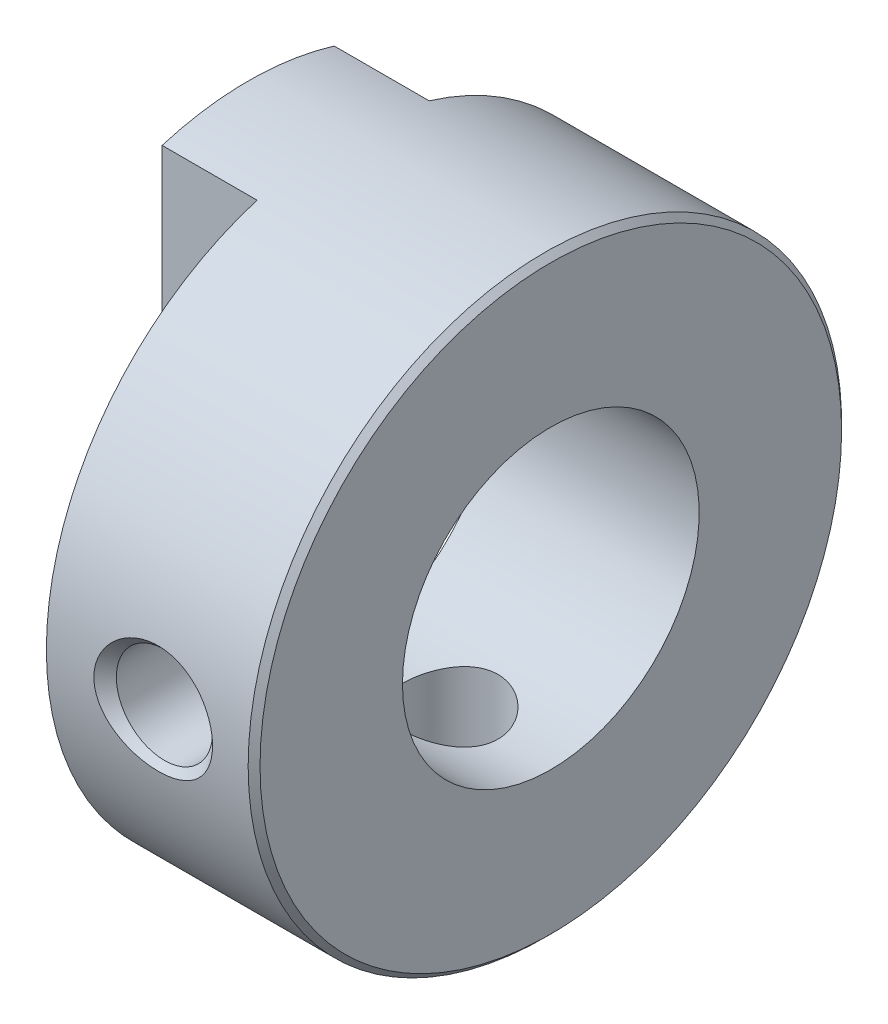
ISO-10303-21;
HEADER;
FILE_DESCRIPTION(('STEP AP214'),'2;1');
FILE_NAME('part.step','',(''),(''),'','','');
FILE_SCHEMA(('AUTOMOTIVE_DESIGN { 1 0 10303 214 1 1 1 1 }'));
ENDSEC;
DATA;
#1=APPLICATION_CONTEXT('core data for automotive mechanical design processes');
#2=APPLICATION_PROTOCOL_DEFINITION('international standard','automotive_design',2000,#1);
#3=PRODUCT_CONTEXT('',#1,'mechanical');
#4=PRODUCT('Part','Part','',(#3));
#5=PRODUCT_RELATED_PRODUCT_CATEGORY('part','',(#4));
#6=PRODUCT_DEFINITION_FORMATION('','',#4);
#7=PRODUCT_DEFINITION_CONTEXT('part definition',#1,'design');
#8=PRODUCT_DEFINITION('design','',#6,#7);
#9=PRODUCT_DEFINITION_SHAPE('','',#8);
#10=(LENGTH_UNIT() NAMED_UNIT(*) SI_UNIT(.MILLI.,.METRE.));
#11=(NAMED_UNIT(*) PLANE_ANGLE_UNIT() SI_UNIT($,.RADIAN.));
#12=(NAMED_UNIT(*) SI_UNIT($,.STERADIAN.) SOLID_ANGLE_UNIT());
#13=UNCERTAINTY_MEASURE_WITH_UNIT(LENGTH_MEASURE(1.E-05),#10,'distance_accuracy_value','');
#14=(GEOMETRIC_REPRESENTATION_CONTEXT(3) GLOBAL_UNCERTAINTY_ASSIGNED_CONTEXT((#13)) GLOBAL_UNIT_ASSIGNED_CONTEXT((#10,
#11,#12)) REPRESENTATION_CONTEXT('',''));
#15=CARTESIAN_POINT('',(0.,0.,0.));
#16=DIRECTION('',(0.,0.,1.));
#17=DIRECTION('',(1.,0.,0.));
#18=AXIS2_PLACEMENT_3D('',#15,#16,#17);
#19=CARTESIAN_POINT('',(7.3,-4.8105,0.));
#20=DIRECTION('',(0.,1.,0.));
#21=DIRECTION('',(0.,0.,1.));
#22=AXIS2_PLACEMENT_3D('',#19,#20,#21);
#23=CYLINDRICAL_SURFACE('',#22,1.621);
#24=CARTESIAN_POINT('',(7.3,-9.62099999998145,0.));
#25=DIRECTION('',(0.,-1.,0.));
#26=DIRECTION('',(0.,0.,-1.));
#27=AXIS2_PLACEMENT_3D('',#24,#25,#26);
#28=CIRCLE('',#27,1.62099999994325);
#29=CARTESIAN_POINT('',(7.3,-9.62099999998145,-1.62099999994325));
#30=VERTEX_POINT('',#29);
#31=EDGE_CURVE('E99',#30,#30,#28,.T.);
#32=ORIENTED_EDGE('',*,*,#31,.T.);
#33=EDGE_LOOP('',(#32));
#34=FACE_BOUND('',#33,.T.);
#35=CARTESIAN_POINT('',(7.3,-4.7299428114936,1.621));
#36=CARTESIAN_POINT('',(7.38832422284981,-4.72994698899165,1.62099495666801));
#37=CARTESIAN_POINT('',(7.47674190842721,-4.73244787339607,1.61374671481636));
#38=CARTESIAN_POINT('',(7.65105585751997,-4.74215007953435,1.5850020391228));
#39=CARTESIAN_POINT('',(7.73694750257078,-4.74935951189662,1.56348101896145));
#40=CARTESIAN_POINT('',(7.90352404228742,-4.7675736609542,1.50702106075937));
#41=CARTESIAN_POINT('',(7.98422126785295,-4.77856896392495,1.47211537999241));
#42=CARTESIAN_POINT('',(8.13861003543614,-4.80310370751553,1.38997281233635));
#43=CARTESIAN_POINT('',(8.21230234574586,-4.81664286864159,1.34273727990673));
#44=CARTESIAN_POINT('',(8.35335823078501,-4.84530578877992,1.23539208930279));
#45=CARTESIAN_POINT('',(8.42042483757003,-4.86046757232821,1.17490221978386));
#46=CARTESIAN_POINT('',(8.54366524737991,-4.89034562081855,1.04357520200886));
#47=CARTESIAN_POINT('',(8.59983684125703,-4.90506179489632,0.972735960337549));
#48=CARTESIAN_POINT('',(8.70101358464609,-4.93282554667559,0.820578202272962));
#49=CARTESIAN_POINT('',(8.74571136220709,-4.94582339715119,0.739045426104685));
#50=CARTESIAN_POINT('',(8.82064193072922,-4.96824175614928,0.569125871752058));
#51=CARTESIAN_POINT('',(8.85087846670559,-4.97766319072258,0.480740874978999));
#52=CARTESIAN_POINT('',(8.89503214573903,-4.99159902806261,0.302725730233392));
#53=CARTESIAN_POINT('',(8.90945562253032,-4.99626531874226,0.213233280255264));
#54=CARTESIAN_POINT('',(8.92318116381357,-5.00070305142235,0.0329849354117743));
#55=CARTESIAN_POINT('',(8.92248691454288,-5.00047568666956,-0.0577706460636812));
#56=CARTESIAN_POINT('',(8.90632322734271,-4.99525592640369,-0.234393693235525));
#57=CARTESIAN_POINT('',(8.89140333710299,-4.99044076600698,-0.320317537198477));
#58=CARTESIAN_POINT('',(8.84811738804956,-4.97680691751369,-0.488368815244507));
#59=CARTESIAN_POINT('',(8.81975037245378,-4.96798794454204,-0.570495978731948));
#60=CARTESIAN_POINT('',(8.75003954655479,-4.94710600807936,-0.729855170497704));
#61=CARTESIAN_POINT('',(8.7085344498836,-4.93500300803599,-0.807011181818475));
#62=CARTESIAN_POINT('',(8.61385918625771,-4.90882059429379,-0.953425380976099));
#63=CARTESIAN_POINT('',(8.56068652917728,-4.8947407589242,-1.02268187807223));
#64=CARTESIAN_POINT('',(8.44140184620217,-4.86535445959904,-1.15459862188282));
#65=CARTESIAN_POINT('',(8.37481906527925,-4.85002129307937,-1.21682780413248));
#66=CARTESIAN_POINT('',(8.23199911013312,-4.82038486203933,-1.32939386947531));
#67=CARTESIAN_POINT('',(8.1557572962003,-4.8060820976858,-1.37972500382847));
#68=CARTESIAN_POINT('',(7.99445969264051,-4.77998110434209,-1.46762338879329));
#69=CARTESIAN_POINT('',(7.90929849745427,-4.76821942684763,-1.50500850150338));
#70=CARTESIAN_POINT('',(7.73350657126083,-4.74896913992852,-1.56470186109034));
#71=CARTESIAN_POINT('',(7.64288787417635,-4.74147148408145,-1.58704204554023));
#72=CARTESIAN_POINT('',(7.50952408640662,-4.73439813615582,-1.60795244109759));
#73=CARTESIAN_POINT('',(7.46779361080764,-4.73273299529697,-1.61283923748477));
#74=CARTESIAN_POINT('',(7.38404914749921,-4.73050433607812,-1.61936422533902));
#75=CARTESIAN_POINT('',(7.34203515834305,-4.72994082334374,-1.62100240021652));
#76=CARTESIAN_POINT('',(7.21167577715019,-4.72994698899165,-1.62099495666801));
#77=CARTESIAN_POINT('',(7.12325809157279,-4.73244787339607,-1.61374671481636));
#78=CARTESIAN_POINT('',(6.94894414248003,-4.74215007953435,-1.5850020391228));
#79=CARTESIAN_POINT('',(6.86305249742922,-4.74935951189662,-1.56348101896145));
#80=CARTESIAN_POINT('',(6.69647595771258,-4.7675736609542,-1.50702106075937));
#81=CARTESIAN_POINT('',(6.61577873214705,-4.77856896392495,-1.47211537999241));
#82=CARTESIAN_POINT('',(6.46138996456386,-4.80310370751553,-1.38997281233635));
#83=CARTESIAN_POINT('',(6.38769765425414,-4.81664286864159,-1.34273727990673));
#84=CARTESIAN_POINT('',(6.24664176921499,-4.84530578877992,-1.23539208930278));
#85=CARTESIAN_POINT('',(6.17957516242997,-4.86046757232821,-1.17490221978386));
#86=CARTESIAN_POINT('',(6.05633475262009,-4.89034562081855,-1.04357520200886));
#87=CARTESIAN_POINT('',(6.00016315874297,-4.90506179489632,-0.972735960337547));
#88=CARTESIAN_POINT('',(5.89898641535391,-4.93282554667559,-0.82057820227296));
#89=CARTESIAN_POINT('',(5.85428863779291,-4.94582339715119,-0.739045426104684));
#90=CARTESIAN_POINT('',(5.77935806927078,-4.96824175614928,-0.569125871752056));
#91=CARTESIAN_POINT('',(5.74912153329441,-4.97766319072258,-0.480740874978997));
#92=CARTESIAN_POINT('',(5.70496785426097,-4.99159902806261,-0.302725730233391));
#93=CARTESIAN_POINT('',(5.69054437746968,-4.99626531874226,-0.213233280255263));
#94=CARTESIAN_POINT('',(5.67681883618643,-5.00070305142235,-0.0329849354117733));
#95=CARTESIAN_POINT('',(5.67751308545712,-5.00047568666956,0.0577706460636821));
#96=CARTESIAN_POINT('',(5.69367677265729,-4.99525592640369,0.234393693235526));
#97=CARTESIAN_POINT('',(5.70859666289702,-4.99044076600698,0.320317537198479));
#98=CARTESIAN_POINT('',(5.75188261195044,-4.97680691751369,0.488368815244508));
#99=CARTESIAN_POINT('',(5.78024962754622,-4.96798794454204,0.570495978731949));
#100=CARTESIAN_POINT('',(5.84996045344521,-4.94710600807936,0.729855170497704));
#101=CARTESIAN_POINT('',(5.8914655501164,-4.93500300803599,0.807011181818475));
#102=CARTESIAN_POINT('',(5.98614081374229,-4.90882059429379,0.953425380976099));
#103=CARTESIAN_POINT('',(6.03931347082272,-4.8947407589242,1.02268187807223));
#104=CARTESIAN_POINT('',(6.15859815379784,-4.86535445959903,1.15459862188282));
#105=CARTESIAN_POINT('',(6.22518093472075,-4.85002129307937,1.21682780413248));
#106=CARTESIAN_POINT('',(6.36800088986689,-4.82038486203933,1.32939386947531));
#107=CARTESIAN_POINT('',(6.4442427037997,-4.8060820976858,1.37972500382847));
#108=CARTESIAN_POINT('',(6.6055403073595,-4.77998110434209,1.46762338879329));
#109=CARTESIAN_POINT('',(6.69070150254573,-4.76821942684763,1.50500850150338));
#110=CARTESIAN_POINT('',(6.86649342873917,-4.74896913992852,1.56470186109034));
#111=CARTESIAN_POINT('',(6.95711212582365,-4.74147148408144,1.58704204554023));
#112=CARTESIAN_POINT('',(7.09047591359338,-4.73439813615582,1.60795244109759));
#113=CARTESIAN_POINT('',(7.13220638919236,-4.73273299529697,1.61283923748477));
#114=CARTESIAN_POINT('',(7.21595085250079,-4.73050433607812,1.61936422533902));
#115=CARTESIAN_POINT('',(7.25796484165695,-4.72994082334373,1.62100240021652));
#116=CARTESIAN_POINT('',(7.3,-4.7299428114936,1.621));
#117=B_SPLINE_CURVE_WITH_KNOTS('',3,(#35,#36,#37,#38,#39,#40,#41,#42,#43,#44,#45,#46,#47,#48,
#49,#50,#51,#52,#53,#54,#55,#56,#57,#58,#59,#60,#61,#62,#63,#64,#65,#66,#67,#68,#69,#70,#71,#72,
#73,#74,#75,#76,#77,#78,#79,#80,#81,#82,#83,#84,#85,#86,#87,#88,#89,#90,#91,#92,#93,#94,#95,#96,
#97,#98,#99,#100,#101,#102,#103,#104,#105,#106,#107,#108,#109,#110,#111,#112,#113,#114,#115,
#116),.UNSPECIFIED.,.T.,.F.,(4,2,2,2,2,2,2,2,2,2,2,2,2,2,2,2,2,2,2,2,2,2,2,2,2,2,2,2,2,2,2,2,2,
2,2,2,2,2,2,2,4),(0.,0.264809590369286,0.530076531290413,0.79468858220667,1.05927157717111,
1.33277097070679,1.60632576301808,1.88658416230314,2.16676994396102,2.43769548297377,
2.70855496147908,2.96935765010709,3.23017889800305,3.49433506090683,3.75854765574025,
4.03452570531057,4.31063682697136,4.59048820588875,4.86974362403357,4.99577084351573,
5.12179870657272,5.386608296942,5.65187523786313,5.91648728877938,6.18107028374383,
6.4545696772795,6.7281244695908,7.00838286887585,7.28856865053373,7.55949418954649,
7.8303536680518,8.09115635667981,8.35197760457576,8.61613376747955,8.88034636231297,
9.15632441188329,9.43243553354408,9.71228691246147,9.99154233060629,10.1175695500884,
10.2435974131454),.UNSPECIFIED.);
#118=CARTESIAN_POINT('',(7.3,-4.7299428114936,1.621));
#119=VERTEX_POINT('',#118);
#120=EDGE_CURVE('E105',#119,#119,#117,.T.);
#121=ORIENTED_EDGE('',*,*,#120,.T.);
#122=EDGE_LOOP('',(#121));
#123=FACE_BOUND('',#122,.T.);
#124=ADVANCED_FACE('F17',(#34,#123),#23,.F.);
#125=CARTESIAN_POINT('',(0.5,0.,-7.5));
#126=DIRECTION('',(-1.,0.,0.));
#127=DIRECTION('',(0.,0.,1.));
#128=AXIS2_PLACEMENT_3D('',#125,#126,#127);
#129=PLANE('',#128);
#130=DIRECTION('',(0.,1.,0.));
#131=VECTOR('',#130,1.);
#132=CARTESIAN_POINT('',(0.5,-10.,-2.9));
#133=LINE('',#132,#131);
#134=CARTESIAN_POINT('',(0.5,-4.07308237088326,-2.9));
#135=VERTEX_POINT('',#134);
#136=CARTESIAN_POINT('',(0.5,-9.57026645397086,-2.9));
#137=VERTEX_POINT('',#136);
#138=EDGE_CURVE('E85',#135,#137,#133,.F.);
#139=ORIENTED_EDGE('',*,*,#138,.T.);
#140=CARTESIAN_POINT('',(0.5,0.,0.));
#141=DIRECTION('',(-1.,0.,0.));
#142=DIRECTION('',(0.,0.,1.));
#143=AXIS2_PLACEMENT_3D('',#140,#141,#142);
#144=CIRCLE('',#143,10.);
#145=CARTESIAN_POINT('',(0.5,-9.57026645397086,2.9));
#146=VERTEX_POINT('',#145);
#147=EDGE_CURVE('E113',#146,#137,#144,.F.);
#148=ORIENTED_EDGE('',*,*,#147,.F.);
#149=DIRECTION('',(0.,1.,0.));
#150=VECTOR('',#149,1.);
#151=CARTESIAN_POINT('',(0.5,10.,2.9));
#152=LINE('',#151,#150);
#153=CARTESIAN_POINT('',(0.5,-4.07308237088326,2.9));
#154=VERTEX_POINT('',#153);
#155=EDGE_CURVE('E81',#146,#154,#152,.T.);
#156=ORIENTED_EDGE('',*,*,#155,.T.);
#157=CARTESIAN_POINT('',(0.5,0.,0.));
#158=DIRECTION('',(-1.,0.,0.));
#159=DIRECTION('',(0.,0.,1.));
#160=AXIS2_PLACEMENT_3D('',#157,#158,#159);
#161=CIRCLE('',#160,5.);
#162=EDGE_CURVE('E21',#154,#135,#161,.F.);
#163=ORIENTED_EDGE('',*,*,#162,.T.);
#164=EDGE_LOOP('',(#139,#148,#156,#163));
#165=FACE_BOUND('',#164,.T.);
#166=ADVANCED_FACE('F84',(#165),#129,.T.);
#167=CARTESIAN_POINT('',(7.3,-10.0022739999872,0.));
#168=DIRECTION('',(0.,-1.,0.));
#169=DIRECTION('',(0.,0.,-1.));
#170=AXIS2_PLACEMENT_3D('',#167,#168,#169);
#171=CONICAL_SURFACE('',#170,2.00227399994901,0.785398163397448);
#172=CARTESIAN_POINT('',(7.3,-9.8309518948513,-1.8309518948131));
#173=CARTESIAN_POINT('',(7.18031485763137,-9.83095361193345,-1.83094915292485));
#174=CARTESIAN_POINT('',(7.06059081220862,-9.83281380497354,-1.82103978946495));
#175=CARTESIAN_POINT('',(6.8244799315036,-9.84004196919652,-1.78156284070458));
#176=CARTESIAN_POINT('',(6.70809502195442,-9.84541192368965,-1.75198414041056));
#177=CARTESIAN_POINT('',(6.4822417972709,-9.85901352733821,-1.67374463778516));
#178=CARTESIAN_POINT('',(6.37276506741411,-9.86724161231807,-1.62510759216024));
#179=CARTESIAN_POINT('',(6.16401273439158,-9.88556413454977,-1.50964361570958));
#180=CARTESIAN_POINT('',(6.06473529022312,-9.89565823405611,-1.44281997559499));
#181=CARTESIAN_POINT('',(5.88299828799096,-9.91608399654581,-1.29485733873551));
#182=CARTESIAN_POINT('',(5.80008727712654,-9.9263964208444,-1.21427191604115));
#183=CARTESIAN_POINT('',(5.65038108182838,-9.94625175816399,-1.03913758195996));
#184=CARTESIAN_POINT('',(5.58358327652092,-9.95579479616022,-0.94459094545591));
#185=CARTESIAN_POINT('',(5.47390577110169,-9.97210037424294,-0.752187437851014));
#186=CARTESIAN_POINT('',(5.42955173043127,-9.97902317696616,-0.6551844588357));
#187=CARTESIAN_POINT('',(5.3595830115405,-9.99016004892143,-0.45464513746668));
#188=CARTESIAN_POINT('',(5.33391715242598,-9.99438151237297,-0.351127488980387));
#189=CARTESIAN_POINT('',(5.31219329750117,-9.99797268138062,-0.205488675692612));
#190=CARTESIAN_POINT('',(5.30762751173329,-9.99873067356051,-0.164536756216242));
#191=CARTESIAN_POINT('',(5.30152920149811,-9.99974485752797,-0.0823973088462192));
#192=CARTESIAN_POINT('',(5.29999691142777,-10.0000010105386,-0.0412097629924014));
#193=CARTESIAN_POINT('',(5.30000746601794,-9.999997557256,0.0996148195594561));
#194=CARTESIAN_POINT('',(5.30898639307848,-9.99849246710755,0.199359457382444));
#195=CARTESIAN_POINT('',(5.34447766666536,-9.99265314107772,0.395701415039371));
#196=CARTESIAN_POINT('',(5.37102346540433,-9.9883135076419,0.492292360396334));
#197=CARTESIAN_POINT('',(5.4381482292512,-9.97768776991836,0.673394623119381));
#198=CARTESIAN_POINT('',(5.47773853174431,-9.97154140436693,0.75828359150309));
#199=CARTESIAN_POINT('',(5.56961659558262,-9.95786104480937,0.920679783194251));
#200=CARTESIAN_POINT('',(5.62189975933609,-9.95032755348426,0.998189665224369));
#201=CARTESIAN_POINT('',(5.74147921136108,-9.93402563712781,1.14948934676536));
#202=CARTESIAN_POINT('',(5.80956498025499,-9.92520780676817,1.22264880523604));
#203=CARTESIAN_POINT('',(5.95619430541766,-9.90764731009398,1.35763372379204));
#204=CARTESIAN_POINT('',(6.03474377215989,-9.89890468925522,1.41945273090422));
#205=CARTESIAN_POINT('',(6.20768227505609,-9.88154739575174,1.53583791043309));
#206=CARTESIAN_POINT('',(6.30286128485155,-9.87301573087596,1.58924328379134));
#207=CARTESIAN_POINT('',(6.50048659030413,-9.85788276125487,1.68056476871691));
#208=CARTESIAN_POINT('',(6.60293214286391,-9.85128125947823,1.718482461426));
#209=CARTESIAN_POINT('',(6.80379770678429,-9.84110555960024,1.77578544019248));
#210=CARTESIAN_POINT('',(6.90184576369184,-9.83732552440246,1.79644800919367));
#211=CARTESIAN_POINT('',(7.09991999128178,-9.83224782280948,1.82403322113373));
#212=CARTESIAN_POINT('',(7.1999464019108,-9.83095045941626,1.8309541869588));
#213=CARTESIAN_POINT('',(7.41968514236863,-9.83095361193345,1.83094915292485));
#214=CARTESIAN_POINT('',(7.53940918779137,-9.83281380497355,1.82103978946495));
#215=CARTESIAN_POINT('',(7.77552006849639,-9.84004196919652,1.78156284070458));
#216=CARTESIAN_POINT('',(7.89190497804558,-9.84541192368965,1.75198414041056));
#217=CARTESIAN_POINT('',(8.1177582027291,-9.85901352733821,1.67374463778516));
#218=CARTESIAN_POINT('',(8.2272349325859,-9.86724161231807,1.62510759216023));
#219=CARTESIAN_POINT('',(8.43598726560843,-9.88556413454977,1.50964361570958));
#220=CARTESIAN_POINT('',(8.53526470977689,-9.89565823405612,1.44281997559498));
#221=CARTESIAN_POINT('',(8.71700171200903,-9.9160839965458,1.29485733873552));
#222=CARTESIAN_POINT('',(8.79991272287344,-9.92639642084439,1.21427191604117));
#223=CARTESIAN_POINT('',(8.94961891817161,-9.94625175816399,1.03913758195998));
#224=CARTESIAN_POINT('',(9.01641672347906,-9.95579479616026,0.944590945455919));
#225=CARTESIAN_POINT('',(9.12609422889832,-9.97210037424291,0.752187437851));
#226=CARTESIAN_POINT('',(9.17044826956879,-9.97902317696605,0.655184458835672));
#227=CARTESIAN_POINT('',(9.24041698845946,-9.99016004892153,0.454645137466648));
#228=CARTESIAN_POINT('',(9.26608284757386,-9.99438151237337,0.351127488980367));
#229=CARTESIAN_POINT('',(9.28780670249889,-9.99797268138047,0.205488675692607));
#230=CARTESIAN_POINT('',(9.29237248826688,-9.9987306735601,0.164536756216233));
#231=CARTESIAN_POINT('',(9.29847079850173,-9.99974485752839,0.0823973088461865));
#232=CARTESIAN_POINT('',(9.30000308857164,-10.0000010105401,0.0412097629923489));
#233=CARTESIAN_POINT('',(9.29999253398081,-9.99999755725915,-0.0996148195595458));
#234=CARTESIAN_POINT('',(9.29101360692117,-9.9984924671084,-0.19935945738255));
#235=CARTESIAN_POINT('',(9.25552233333495,-9.99265314107687,-0.395701415039453));
#236=CARTESIAN_POINT('',(9.22897653459575,-9.98831350764168,-0.492292360396374));
#237=CARTESIAN_POINT('',(9.16185177074872,-9.97768776991857,-0.673394623119372));
#238=CARTESIAN_POINT('',(9.12226146825568,-9.97154140436699,-0.758283591503072));
#239=CARTESIAN_POINT('',(9.03038340441742,-9.95786104480932,-0.920679783194235));
#240=CARTESIAN_POINT('',(8.97810024066392,-9.95032755348425,-0.998189665224363));
#241=CARTESIAN_POINT('',(8.85852078863891,-9.93402563712783,-1.14948934676537));
#242=CARTESIAN_POINT('',(8.790435019745,-9.92520780676817,-1.22264880523605));
#243=CARTESIAN_POINT('',(8.64380569458233,-9.90764731009397,-1.35763372379205));
#244=CARTESIAN_POINT('',(8.5652562278401,-9.89890468925522,-1.41945273090423));
#245=CARTESIAN_POINT('',(8.39231772494391,-9.88154739575174,-1.53583791043309));
#246=CARTESIAN_POINT('',(8.29713871514845,-9.87301573087596,-1.58924328379134));
#247=CARTESIAN_POINT('',(8.09951340969587,-9.85788276125487,-1.68056476871691));
#248=CARTESIAN_POINT('',(7.99706785713609,-9.85128125947823,-1.718482461426));
#249=CARTESIAN_POINT('',(7.79620229321571,-9.84110555960024,-1.77578544019248));
#250=CARTESIAN_POINT('',(7.69815423630815,-9.83732552440246,-1.79644800919367));
#251=CARTESIAN_POINT('',(7.50008000871822,-9.83224782280948,-1.82403322113373));
#252=CARTESIAN_POINT('',(7.4000535980892,-9.83095045941626,-1.8309541869588));
#253=CARTESIAN_POINT('',(7.3,-9.8309518948513,-1.8309518948131));
#254=B_SPLINE_CURVE_WITH_KNOTS('',3,(#172,#173,#174,#175,#176,#177,#178,#179,#180,#181,#182,
#183,#184,#185,#186,#187,#188,#189,#190,#191,#192,#193,#194,#195,#196,#197,#198,#199,#200,#201,
#202,#203,#204,#205,#206,#207,#208,#209,#210,#211,#212,#213,#214,#215,#216,#217,#218,#219,#220,
#221,#222,#223,#224,#225,#226,#227,#228,#229,#230,#231,#232,#233,#234,#235,#236,#237,#238,#239,
#240,#241,#242,#243,#244,#245,#246,#247,#248,#249,#250,#251,#252,#253),.UNSPECIFIED.,.T.,.F.,(4,
2,2,2,2,2,2,2,2,2,2,2,2,2,2,2,2,2,2,2,2,2,2,2,2,2,2,2,2,2,2,2,2,2,2,2,2,2,2,2,4),(0.,
0.358700295485909,0.717603462243117,1.07606066313242,1.43445304728161,1.78085804116018,
2.12720665290949,2.44614975897479,2.76421606336215,2.88776234834119,3.01131817931744,
3.30998507071616,3.60922234995367,3.88962123562719,4.16991870672219,4.46964658449002,
4.76954448872089,5.09655231706789,5.42352675274244,5.72335407580457,6.02321798947639,
6.38191828496229,6.7408214517195,7.09927865260883,7.457671036758,7.80407603063653,
8.15042464238588,8.46936774845122,8.78743405283854,8.91098033781759,9.03453616879388,
9.3332030601926,9.63244033943,9.91283922510348,10.1931366961985,10.4928645739664,
10.7927624781972,11.1197703065442,11.4467447422188,11.7465720652809,12.0464359789527),.UNSPECIFIED.);
#255=CARTESIAN_POINT('',(7.3,-9.8309518948513,-1.8309518948131));
#256=VERTEX_POINT('',#255);
#257=EDGE_CURVE('E112',#256,#256,#254,.T.);
#258=ORIENTED_EDGE('',*,*,#257,.F.);
#259=EDGE_LOOP('',(#258));
#260=FACE_BOUND('',#259,.T.);
#261=ORIENTED_EDGE('',*,*,#31,.F.);
#262=EDGE_LOOP('',(#261));
#263=FACE_BOUND('',#262,.T.);
#264=ADVANCED_FACE('F147',(#260,#263),#171,.F.);
#265=CARTESIAN_POINT('',(0.5,-10.,-2.9));
#266=DIRECTION('',(0.,0.,1.));
#267=DIRECTION('',(1.,0.,0.));
#268=AXIS2_PLACEMENT_3D('',#265,#266,#267);
#269=PLANE('',#268);
#270=ORIENTED_EDGE('',*,*,#138,.F.);
#271=DIRECTION('',(-1.,0.,0.));
#272=VECTOR('',#271,1.);
#273=CARTESIAN_POINT('',(5.6,-4.07308237088326,-2.9));
#274=LINE('',#273,#272);
#275=CARTESIAN_POINT('',(3.7,-4.07308237088326,-2.9));
#276=VERTEX_POINT('',#275);
#277=EDGE_CURVE('E90',#135,#276,#274,.F.);
#278=ORIENTED_EDGE('',*,*,#277,.T.);
#279=DIRECTION('',(0.,1.,0.));
#280=VECTOR('',#279,1.);
#281=CARTESIAN_POINT('',(3.7,0.,-2.9));
#282=LINE('',#281,#280);
#283=CARTESIAN_POINT('',(3.7,-9.57026645397086,-2.9));
#284=VERTEX_POINT('',#283);
#285=EDGE_CURVE('E144',#284,#276,#282,.T.);
#286=ORIENTED_EDGE('',*,*,#285,.F.);
#287=DIRECTION('',(-1.,0.,0.));
#288=VECTOR('',#287,1.);
#289=CARTESIAN_POINT('',(5.5,-9.57026645397086,-2.9));
#290=LINE('',#289,#288);
#291=EDGE_CURVE('E97',#137,#284,#290,.F.);
#292=ORIENTED_EDGE('',*,*,#291,.F.);
#293=EDGE_LOOP('',(#270,#278,#286,#292));
#294=FACE_BOUND('',#293,.T.);
#295=ADVANCED_FACE('F93',(#294),#269,.F.);
#296=CARTESIAN_POINT('',(5.6,0.,0.));
#297=DIRECTION('',(-1.,0.,0.));
#298=DIRECTION('',(0.,0.,1.));
#299=AXIS2_PLACEMENT_3D('',#296,#297,#298);
#300=CYLINDRICAL_SURFACE('',#299,5.);
#301=CARTESIAN_POINT('',(7.3,-1.621,4.7299428114936));
#302=CARTESIAN_POINT('',(7.38838793956723,-1.62099615382014,4.7299460726129));
#303=CARTESIAN_POINT('',(7.4768209595644,-1.61374112191029,4.73244969190483));
#304=CARTESIAN_POINT('',(7.65111778599757,-1.5849843593927,4.74215611922495));
#305=CARTESIAN_POINT('',(7.73697915396427,-1.56346952825927,4.74936324828994));
#306=CARTESIAN_POINT('',(7.90351953727884,-1.50702334874817,4.76757289344653));
#307=CARTESIAN_POINT('',(7.98420926929098,-1.47212086535421,4.77856723879521));
#308=CARTESIAN_POINT('',(8.13859808338542,-1.38998007050231,4.80310162588651));
#309=CARTESIAN_POINT('',(8.21229685206788,-1.34274120636923,4.8166417816749));
#310=CARTESIAN_POINT('',(8.35335332529039,-1.23539608526392,4.84530476162284));
#311=CARTESIAN_POINT('',(8.42041536289458,-1.17491132632733,4.8604654416043));
#312=CARTESIAN_POINT('',(8.54365733591412,-1.04358462264169,4.89034353612307));
#313=CARTESIAN_POINT('',(8.59983352875819,-0.972739130492268,4.90506079674867));
#314=CARTESIAN_POINT('',(8.701037252595,-0.820544465073786,4.93283213275176));
#315=CARTESIAN_POINT('',(8.74575219604474,-0.738977597012532,4.94583564315422));
#316=CARTESIAN_POINT('',(8.82067124435153,-0.569034641163645,4.96825050056049));
#317=CARTESIAN_POINT('',(8.85089256871116,-0.480666779111126,4.97766610751451));
#318=CARTESIAN_POINT('',(8.88911672955297,-0.326587150258482,4.98973307709506));
#319=CARTESIAN_POINT('',(8.90104891603746,-0.261915386126399,4.99356184924025));
#320=CARTESIAN_POINT('',(8.91699167239445,-0.131503946543917,4.99869621532877));
#321=CARTESIAN_POINT('',(8.92100277776454,-0.065764343586768,5.00000197983763));
#322=CARTESIAN_POINT('',(8.92099626084218,0.0885255955464685,4.99999733493417));
#323=CARTESIAN_POINT('',(8.91371938986869,0.177096020963261,4.99762504507006));
#324=CARTESIAN_POINT('',(8.88486797625318,0.351678867713104,4.9883850266478));
#325=CARTESIAN_POINT('',(8.86328082611174,0.437688963488834,4.98151333413636));
#326=CARTESIAN_POINT('',(8.80662347558519,0.604544986591141,4.96402578679964));
#327=CARTESIAN_POINT('',(8.77157888655898,0.685400385252579,4.95341704724089));
#328=CARTESIAN_POINT('',(8.68910254724635,0.840071913564745,4.9295447692433));
#329=CARTESIAN_POINT('',(8.641670556754,0.913887906675422,4.91628117932504));
#330=CARTESIAN_POINT('',(8.53412056820324,1.05483523567841,4.88801042598162));
#331=CARTESIAN_POINT('',(8.47366761131566,1.12170289832987,4.87296317580924));
#332=CARTESIAN_POINT('',(8.34248874357489,1.24456315018154,4.84304346253043));
#333=CARTESIAN_POINT('',(8.27175875754015,1.30055140465536,4.82817107130195));
#334=CARTESIAN_POINT('',(8.1196880569924,1.40153822316147,4.79984606653351));
#335=CARTESIAN_POINT('',(8.03811023451809,1.44619473005539,4.78644334660164));
#336=CARTESIAN_POINT('',(7.86814564903648,1.52100253546362,4.76320273836648));
#337=CARTESIAN_POINT('',(7.77976742320563,1.55117168741764,4.7533604660691));
#338=CARTESIAN_POINT('',(7.62582097567377,1.58926692611162,4.74072730436039));
#339=CARTESIAN_POINT('',(7.56130414607192,1.6011423667579,4.73670911879916));
#340=CARTESIAN_POINT('',(7.43119976510088,1.61701000375735,4.73131577176562));
#341=CARTESIAN_POINT('',(7.36561230315111,1.62100285510353,4.72994039069333));
#342=CARTESIAN_POINT('',(7.21161206043276,1.62099615382014,4.72994607261289));
#343=CARTESIAN_POINT('',(7.12317904043559,1.61374112191029,4.73244969190483));
#344=CARTESIAN_POINT('',(6.94888221400243,1.5849843593927,4.74215611922495));
#345=CARTESIAN_POINT('',(6.86302084603573,1.56346952825927,4.74936324828994));
#346=CARTESIAN_POINT('',(6.69648046272116,1.50702334874817,4.76757289344653));
#347=CARTESIAN_POINT('',(6.61579073070902,1.47212086535421,4.77856723879521));
#348=CARTESIAN_POINT('',(6.46140191661458,1.38998007050231,4.80310162588651));
#349=CARTESIAN_POINT('',(6.38770314793212,1.34274120636923,4.8166417816749));
#350=CARTESIAN_POINT('',(6.2466466747096,1.23539608526392,4.84530476162284));
#351=CARTESIAN_POINT('',(6.17958463710542,1.17491132632733,4.8604654416043));
#352=CARTESIAN_POINT('',(6.05634266408588,1.04358462264169,4.89034353612307));
#353=CARTESIAN_POINT('',(6.00016647124181,0.972739130492265,4.90506079674867));
#354=CARTESIAN_POINT('',(5.89896274740499,0.820544465073783,4.93283213275176));
#355=CARTESIAN_POINT('',(5.85424780395526,0.738977597012529,4.94583564315422));
#356=CARTESIAN_POINT('',(5.77932875564847,0.569034641163642,4.96825050056049));
#357=CARTESIAN_POINT('',(5.74910743128884,0.480666779111124,4.97766610751451));
#358=CARTESIAN_POINT('',(5.71088327044703,0.32658715025848,4.98973307709506));
#359=CARTESIAN_POINT('',(5.69895108396254,0.261915386126396,4.99356184924025));
#360=CARTESIAN_POINT('',(5.68300832760555,0.131503946543915,4.99869621532877));
#361=CARTESIAN_POINT('',(5.67899722223546,0.0657643435867662,5.00000197983763));
#362=CARTESIAN_POINT('',(5.67900373915783,-0.0885255955464701,4.99999733493417));
#363=CARTESIAN_POINT('',(5.68628061013131,-0.177096020963262,4.99762504507006));
#364=CARTESIAN_POINT('',(5.71513202374681,-0.351678867713106,4.9883850266478));
#365=CARTESIAN_POINT('',(5.73671917388826,-0.437688963488835,4.98151333413636));
#366=CARTESIAN_POINT('',(5.79337652441481,-0.604544986591142,4.96402578679964));
#367=CARTESIAN_POINT('',(5.82842111344102,-0.685400385252581,4.95341704724089));
#368=CARTESIAN_POINT('',(5.91089745275365,-0.840071913564747,4.92954476924331));
#369=CARTESIAN_POINT('',(5.958329443246,-0.913887906675423,4.91628117932504));
#370=CARTESIAN_POINT('',(6.06587943179676,-1.05483523567841,4.88801042598162));
#371=CARTESIAN_POINT('',(6.12633238868434,-1.12170289832987,4.87296317580924));
#372=CARTESIAN_POINT('',(6.25751125642511,-1.24456315018154,4.84304346253042));
#373=CARTESIAN_POINT('',(6.32824124245985,-1.30055140465536,4.82817107130195));
#374=CARTESIAN_POINT('',(6.4803119430076,-1.40153822316147,4.79984606653351));
#375=CARTESIAN_POINT('',(6.56188976548192,-1.4461947300554,4.78644334660164));
#376=CARTESIAN_POINT('',(6.73185435096352,-1.52100253546362,4.76320273836647));
#377=CARTESIAN_POINT('',(6.82023257679437,-1.55117168741765,4.7533604660691));
#378=CARTESIAN_POINT('',(6.97417902432623,-1.58926692611162,4.74072730436039));
#379=CARTESIAN_POINT('',(7.03869585392808,-1.6011423667579,4.73670911879916));
#380=CARTESIAN_POINT('',(7.16880023489912,-1.61701000375735,4.73131577176562));
#381=CARTESIAN_POINT('',(7.23438769684889,-1.62100285510354,4.72994039069334));
#382=CARTESIAN_POINT('',(7.3,-1.621,4.7299428114936));
#383=B_SPLINE_CURVE_WITH_KNOTS('',3,(#301,#302,#303,#304,#305,#306,#307,#308,#309,#310,#311,
#312,#313,#314,#315,#316,#317,#318,#319,#320,#321,#322,#323,#324,#325,#326,#327,#328,#329,#330,
#331,#332,#333,#334,#335,#336,#337,#338,#339,#340,#341,#342,#343,#344,#345,#346,#347,#348,#349,
#350,#351,#352,#353,#354,#355,#356,#357,#358,#359,#360,#361,#362,#363,#364,#365,#366,#367,#368,
#369,#370,#371,#372,#373,#374,#375,#376,#377,#378,#379,#380,#381,#382),.UNSPECIFIED.,.T.,.F.,(4,
2,2,2,2,2,2,2,2,2,2,2,2,2,2,2,2,2,2,2,2,2,2,2,2,2,2,2,2,2,2,2,2,2,2,2,2,2,2,2,4),(0.,
0.264916402903829,0.530076523380819,0.794668119502864,1.05927157147553,1.33275173579368,
1.6063257568732,1.88671483229573,2.1667699541857,2.36389319006473,2.56100309914778,
2.82633338510532,3.09189774092573,3.35695917612807,3.62202575155761,3.89496544056384,
4.16801365604413,4.44852213470529,4.72868403693406,4.92535362690224,5.12200687419064,
5.38692327709447,5.65208339757146,5.9166749936935,6.18127844566617,6.45475860998432,
6.72833263106384,7.00872170648637,7.28877682837634,7.48590006425537,7.68300997333842,
7.94834025929596,8.21390461511636,8.47896605031871,8.74403262574826,9.01697231475448,
9.29002053023478,9.57052900889593,9.8506909111247,10.0473605010929,10.2440137483813),.UNSPECIFIED.);
#384=CARTESIAN_POINT('',(7.3,-1.621,4.7299428114936));
#385=VERTEX_POINT('',#384);
#386=EDGE_CURVE('E173',#385,#385,#383,.T.);
#387=ORIENTED_EDGE('',*,*,#386,.T.);
#388=EDGE_LOOP('',(#387));
#389=FACE_BOUND('',#388,.T.);
#390=CARTESIAN_POINT('',(3.7,0.,0.));
#391=DIRECTION('',(-1.,0.,0.));
#392=DIRECTION('',(0.,0.,1.));
#393=AXIS2_PLACEMENT_3D('',#390,#391,#392);
#394=CIRCLE('',#393,5.);
#395=CARTESIAN_POINT('',(3.7,4.07308237088326,2.9));
#396=VERTEX_POINT('',#395);
#397=CARTESIAN_POINT('',(3.7,-4.07308237088326,2.9));
#398=VERTEX_POINT('',#397);
#399=EDGE_CURVE('E203',#396,#398,#394,.F.);
#400=ORIENTED_EDGE('',*,*,#399,.F.);
#401=DIRECTION('',(-1.,0.,0.));
#402=VECTOR('',#401,1.);
#403=CARTESIAN_POINT('',(0.5,4.07308237088326,2.9));
#404=LINE('',#403,#402);
#405=CARTESIAN_POINT('',(0.5,4.07308237088326,2.9));
#406=VERTEX_POINT('',#405);
#407=EDGE_CURVE('E214',#396,#406,#404,.T.);
#408=ORIENTED_EDGE('',*,*,#407,.T.);
#409=CARTESIAN_POINT('',(0.5,0.,0.));
#410=DIRECTION('',(-1.,0.,0.));
#411=DIRECTION('',(0.,0.,1.));
#412=AXIS2_PLACEMENT_3D('',#409,#410,#411);
#413=CIRCLE('',#412,5.);
#414=CARTESIAN_POINT('',(0.5,4.07308237088326,-2.9));
#415=VERTEX_POINT('',#414);
#416=EDGE_CURVE('E212',#415,#406,#413,.F.);
#417=ORIENTED_EDGE('',*,*,#416,.F.);
#418=DIRECTION('',(1.,0.,0.));
#419=VECTOR('',#418,1.);
#420=CARTESIAN_POINT('',(0.5,4.07308237088326,-2.9));
#421=LINE('',#420,#419);
#422=CARTESIAN_POINT('',(3.7,4.07308237088326,-2.9));
#423=VERTEX_POINT('',#422);
#424=EDGE_CURVE('E110',#415,#423,#421,.T.);
#425=ORIENTED_EDGE('',*,*,#424,.T.);
#426=CARTESIAN_POINT('',(3.7,0.,0.));
#427=DIRECTION('',(-1.,0.,0.));
#428=DIRECTION('',(0.,0.,1.));
#429=AXIS2_PLACEMENT_3D('',#426,#427,#428);
#430=CIRCLE('',#429,5.);
#431=EDGE_CURVE('E104',#276,#423,#430,.F.);
#432=ORIENTED_EDGE('',*,*,#431,.F.);
#433=ORIENTED_EDGE('',*,*,#277,.F.);
#434=ORIENTED_EDGE('',*,*,#162,.F.);
#435=DIRECTION('',(-1.,0.,0.));
#436=VECTOR('',#435,1.);
#437=CARTESIAN_POINT('',(0.5,-4.07308237088326,2.9));
#438=LINE('',#437,#436);
#439=EDGE_CURVE('E116',#154,#398,#438,.F.);
#440=ORIENTED_EDGE('',*,*,#439,.T.);
#441=EDGE_LOOP('',(#400,#408,#417,#425,#432,#433,#434,#440));
#442=FACE_BOUND('',#441,.T.);
#443=ORIENTED_EDGE('',*,*,#120,.F.);
#444=EDGE_LOOP('',(#443));
#445=FACE_BOUND('',#444,.T.);
#446=CARTESIAN_POINT('',(10.7,0.,0.));
#447=DIRECTION('',(-1.,0.,0.));
#448=DIRECTION('',(0.,0.,1.));
#449=AXIS2_PLACEMENT_3D('',#446,#447,#448);
#450=CIRCLE('',#449,5.);
#451=CARTESIAN_POINT('',(10.7,0.,5.));
#452=VERTEX_POINT('',#451);
#453=EDGE_CURVE('E170',#452,#452,#450,.T.);
#454=ORIENTED_EDGE('',*,*,#453,.F.);
#455=EDGE_LOOP('',(#454));
#456=FACE_BOUND('',#455,.T.);
#457=ADVANCED_FACE('F101',(#389,#442,#445,#456),#300,.F.);
#458=CARTESIAN_POINT('',(0.5,10.,2.9));
#459=DIRECTION('',(0.,0.,-1.));
#460=DIRECTION('',(-1.,0.,0.));
#461=AXIS2_PLACEMENT_3D('',#458,#459,#460);
#462=PLANE('',#461);
#463=DIRECTION('',(0.,1.,0.));
#464=VECTOR('',#463,1.);
#465=CARTESIAN_POINT('',(3.7,0.,2.9));
#466=LINE('',#465,#464);
#467=CARTESIAN_POINT('',(3.7,-9.57026645397086,2.9));
#468=VERTEX_POINT('',#467);
#469=EDGE_CURVE('E199',#398,#468,#466,.F.);
#470=ORIENTED_EDGE('',*,*,#469,.F.);
#471=ORIENTED_EDGE('',*,*,#439,.F.);
#472=ORIENTED_EDGE('',*,*,#155,.F.);
#473=DIRECTION('',(-1.,0.,0.));
#474=VECTOR('',#473,1.);
#475=CARTESIAN_POINT('',(5.5,-9.57026645397086,2.9));
#476=LINE('',#475,#474);
#477=EDGE_CURVE('E172',#468,#146,#476,.T.);
#478=ORIENTED_EDGE('',*,*,#477,.F.);
#479=EDGE_LOOP('',(#470,#471,#472,#478));
#480=FACE_BOUND('',#479,.T.);
#481=ADVANCED_FACE('F166',(#480),#462,.F.);
#482=CARTESIAN_POINT('',(7.3,0.,4.8105));
#483=DIRECTION('',(0.,0.,-1.));
#484=DIRECTION('',(0.,1.,0.));
#485=AXIS2_PLACEMENT_3D('',#482,#483,#484);
#486=CYLINDRICAL_SURFACE('',#485,1.621);
#487=CARTESIAN_POINT('',(7.3,0.,9.62099999998145));
#488=DIRECTION('',(0.,0.,1.));
#489=DIRECTION('',(0.,-1.,0.));
#490=AXIS2_PLACEMENT_3D('',#487,#488,#489);
#491=CIRCLE('',#490,1.62100000000009);
#492=CARTESIAN_POINT('',(7.3,-1.62100000000009,9.62099999998145));
#493=VERTEX_POINT('',#492);
#494=EDGE_CURVE('E202',#493,#493,#491,.T.);
#495=ORIENTED_EDGE('',*,*,#494,.T.);
#496=EDGE_LOOP('',(#495));
#497=FACE_BOUND('',#496,.T.);
#498=ORIENTED_EDGE('',*,*,#386,.F.);
#499=EDGE_LOOP('',(#498));
#500=FACE_BOUND('',#499,.T.);
#501=ADVANCED_FACE('F185',(#497,#500),#486,.F.);
#502=CARTESIAN_POINT('',(10.7,0.,-7.4));
#503=DIRECTION('',(1.,0.,0.));
#504=DIRECTION('',(0.,0.,-1.));
#505=AXIS2_PLACEMENT_3D('',#502,#503,#504);
#506=PLANE('',#505);
#507=CARTESIAN_POINT('',(10.7,0.,0.));
#508=DIRECTION('',(-1.,0.,0.));
#509=DIRECTION('',(0.,0.,1.));
#510=AXIS2_PLACEMENT_3D('',#507,#508,#509);
#511=CIRCLE('',#510,9.8);
#512=CARTESIAN_POINT('',(10.7,0.,9.8));
#513=VERTEX_POINT('',#512);
#514=EDGE_CURVE('E210',#513,#513,#511,.T.);
#515=ORIENTED_EDGE('',*,*,#514,.F.);
#516=EDGE_LOOP('',(#515));
#517=FACE_BOUND('',#516,.T.);
#518=ORIENTED_EDGE('',*,*,#453,.T.);
#519=EDGE_LOOP('',(#518));
#520=FACE_BOUND('',#519,.T.);
#521=ADVANCED_FACE('F189',(#517,#520),#506,.T.);
#522=CARTESIAN_POINT('',(3.7,0.,0.));
#523=DIRECTION('',(-1.,0.,0.));
#524=DIRECTION('',(0.,0.,1.));
#525=AXIS2_PLACEMENT_3D('',#522,#523,#524);
#526=PLANE('',#525);
#527=DIRECTION('',(0.,1.,0.));
#528=VECTOR('',#527,1.);
#529=CARTESIAN_POINT('',(3.7,-10.,-2.9));
#530=LINE('',#529,#528);
#531=CARTESIAN_POINT('',(3.7,9.57026645397086,-2.9));
#532=VERTEX_POINT('',#531);
#533=EDGE_CURVE('E220',#423,#532,#530,.T.);
#534=ORIENTED_EDGE('',*,*,#533,.T.);
#535=CARTESIAN_POINT('',(3.7,0.,0.));
#536=DIRECTION('',(-1.,0.,0.));
#537=DIRECTION('',(0.,0.,1.));
#538=AXIS2_PLACEMENT_3D('',#535,#536,#537);
#539=CIRCLE('',#538,10.);
#540=EDGE_CURVE('E230',#284,#532,#539,.F.);
#541=ORIENTED_EDGE('',*,*,#540,.F.);
#542=ORIENTED_EDGE('',*,*,#285,.T.);
#543=ORIENTED_EDGE('',*,*,#431,.T.);
#544=EDGE_LOOP('',(#534,#541,#542,#543));
#545=FACE_BOUND('',#544,.T.);
#546=ADVANCED_FACE('F246',(#545),#526,.T.);
#547=CARTESIAN_POINT('',(0.5,-10.,-2.9));
#548=DIRECTION('',(0.,0.,1.));
#549=DIRECTION('',(1.,0.,0.));
#550=AXIS2_PLACEMENT_3D('',#547,#548,#549);
#551=PLANE('',#550);
#552=ORIENTED_EDGE('',*,*,#533,.F.);
#553=ORIENTED_EDGE('',*,*,#424,.F.);
#554=DIRECTION('',(0.,1.,0.));
#555=VECTOR('',#554,1.);
#556=CARTESIAN_POINT('',(0.5,0.,-2.9));
#557=LINE('',#556,#555);
#558=CARTESIAN_POINT('',(0.5,9.57026645397086,-2.9));
#559=VERTEX_POINT('',#558);
#560=EDGE_CURVE('E215',#559,#415,#557,.F.);
#561=ORIENTED_EDGE('',*,*,#560,.F.);
#562=DIRECTION('',(-1.,0.,0.));
#563=VECTOR('',#562,1.);
#564=CARTESIAN_POINT('',(5.5,9.57026645397086,-2.9));
#565=LINE('',#564,#563);
#566=EDGE_CURVE('E227',#532,#559,#565,.T.);
#567=ORIENTED_EDGE('',*,*,#566,.F.);
#568=EDGE_LOOP('',(#552,#553,#561,#567));
#569=FACE_BOUND('',#568,.T.);
#570=ADVANCED_FACE('F250',(#569),#551,.F.);
#571=CARTESIAN_POINT('',(0.5,0.,-7.5));
#572=DIRECTION('',(-1.,0.,0.));
#573=DIRECTION('',(0.,0.,1.));
#574=AXIS2_PLACEMENT_3D('',#571,#572,#573);
#575=PLANE('',#574);
#576=ORIENTED_EDGE('',*,*,#560,.T.);
#577=ORIENTED_EDGE('',*,*,#416,.T.);
#578=DIRECTION('',(0.,1.,0.));
#579=VECTOR('',#578,1.);
#580=CARTESIAN_POINT('',(0.5,10.,2.9));
#581=LINE('',#580,#579);
#582=CARTESIAN_POINT('',(0.5,9.57026645397086,2.9));
#583=VERTEX_POINT('',#582);
#584=EDGE_CURVE('E207',#406,#583,#581,.T.);
#585=ORIENTED_EDGE('',*,*,#584,.T.);
#586=CARTESIAN_POINT('',(0.5,0.,0.));
#587=DIRECTION('',(-1.,0.,0.));
#588=DIRECTION('',(0.,0.,1.));
#589=AXIS2_PLACEMENT_3D('',#586,#587,#588);
#590=CIRCLE('',#589,10.);
#591=EDGE_CURVE('E229',#559,#583,#590,.F.);
#592=ORIENTED_EDGE('',*,*,#591,.F.);
#593=EDGE_LOOP('',(#576,#577,#585,#592));
#594=FACE_BOUND('',#593,.T.);
#595=ADVANCED_FACE('F251',(#594),#575,.T.);
#596=CARTESIAN_POINT('',(0.5,10.,2.9));
#597=DIRECTION('',(0.,0.,-1.));
#598=DIRECTION('',(-1.,0.,0.));
#599=AXIS2_PLACEMENT_3D('',#596,#597,#598);
#600=PLANE('',#599);
#601=ORIENTED_EDGE('',*,*,#584,.F.);
#602=ORIENTED_EDGE('',*,*,#407,.F.);
#603=DIRECTION('',(0.,1.,0.));
#604=VECTOR('',#603,1.);
#605=CARTESIAN_POINT('',(3.7,0.,2.9));
#606=LINE('',#605,#604);
#607=CARTESIAN_POINT('',(3.7,9.57026645397086,2.9));
#608=VERTEX_POINT('',#607);
#609=EDGE_CURVE('E36',#608,#396,#606,.F.);
#610=ORIENTED_EDGE('',*,*,#609,.F.);
#611=DIRECTION('',(-1.,0.,0.));
#612=VECTOR('',#611,1.);
#613=CARTESIAN_POINT('',(5.5,9.57026645397086,2.9));
#614=LINE('',#613,#612);
#615=EDGE_CURVE('E242',#583,#608,#614,.F.);
#616=ORIENTED_EDGE('',*,*,#615,.F.);
#617=EDGE_LOOP('',(#601,#602,#610,#616));
#618=FACE_BOUND('',#617,.T.);
#619=ADVANCED_FACE('F252',(#618),#600,.F.);
#620=CARTESIAN_POINT('',(3.7,0.,0.));
#621=DIRECTION('',(-1.,0.,0.));
#622=DIRECTION('',(0.,0.,1.));
#623=AXIS2_PLACEMENT_3D('',#620,#621,#622);
#624=PLANE('',#623);
#625=ORIENTED_EDGE('',*,*,#469,.T.);
#626=CARTESIAN_POINT('',(3.7,0.,0.));
#627=DIRECTION('',(-1.,0.,0.));
#628=DIRECTION('',(0.,0.,1.));
#629=AXIS2_PLACEMENT_3D('',#626,#627,#628);
#630=CIRCLE('',#629,10.);
#631=EDGE_CURVE('E125',#608,#468,#630,.F.);
#632=ORIENTED_EDGE('',*,*,#631,.F.);
#633=ORIENTED_EDGE('',*,*,#609,.T.);
#634=ORIENTED_EDGE('',*,*,#399,.T.);
#635=EDGE_LOOP('',(#625,#632,#633,#634));
#636=FACE_BOUND('',#635,.T.);
#637=ADVANCED_FACE('F205',(#636),#624,.T.);
#638=CARTESIAN_POINT('',(7.3,0.,10.0022739999872));
#639=DIRECTION('',(0.,0.,1.));
#640=DIRECTION('',(1.,0.,0.));
#641=AXIS2_PLACEMENT_3D('',#638,#639,#640);
#642=CONICAL_SURFACE('',#641,2.00227400000585,0.785398163397448);
#643=CARTESIAN_POINT('',(5.29999999998136,0.,10.));
#644=CARTESIAN_POINT('',(5.3000074659624,0.0996148195624415,9.99999755725915));
#645=CARTESIAN_POINT('',(5.30898639302232,0.199359457388421,9.9984924671083));
#646=CARTESIAN_POINT('',(5.34447766660976,0.395701415051134,9.99265314107644));
#647=CARTESIAN_POINT('',(5.37102346534992,0.492292360410891,9.98831350764099));
#648=CARTESIAN_POINT('',(5.4381482291991,0.67339462313858,9.97768776991729));
#649=CARTESIAN_POINT('',(5.47773853169322,0.758283591524187,9.9715414043654));
#650=CARTESIAN_POINT('',(5.56961659553389,0.920679783218983,9.95786104480704));
#651=CARTESIAN_POINT('',(5.62189975928872,0.998189665250838,9.95032755348161));
#652=CARTESIAN_POINT('',(5.74147921131683,1.1494893467954,9.93402563712437));
#653=CARTESIAN_POINT('',(5.80956498021257,1.22264880526788,9.92520780676426));
#654=CARTESIAN_POINT('',(5.95619430537912,1.35763372382719,9.90764731008917));
#655=CARTESIAN_POINT('',(6.0347437721234,1.41945273094089,9.89890468924997));
#656=CARTESIAN_POINT('',(6.20768227502428,1.53583791047278,9.88154739574558));
#657=CARTESIAN_POINT('',(6.30286128482241,1.58924328383247,9.87301573086934));
#658=CARTESIAN_POINT('',(6.50048659028054,1.68056476876051,9.85788276124745));
#659=CARTESIAN_POINT('',(6.6029321428432,1.71848246147064,9.85128125947045));
#660=CARTESIAN_POINT('',(6.80379770676939,1.77578544023877,9.84110555959189));
#661=CARTESIAN_POINT('',(6.90184576367989,1.79644800924057,9.83732552439389));
#662=CARTESIAN_POINT('',(7.09991999127577,1.82403322118145,9.83224782280063));
#663=CARTESIAN_POINT('',(7.19994640190779,1.83095418700672,9.83095045940733));
#664=CARTESIAN_POINT('',(7.41968514237216,1.83094915297277,9.83095361192452));
#665=CARTESIAN_POINT('',(7.53940918779845,1.82103978951259,9.83281380496472));
#666=CARTESIAN_POINT('',(7.77552006851044,1.78156284075108,9.8400419691881));
#667=CARTESIAN_POINT('',(7.89190497806307,1.75198414045621,9.84541192368153));
#668=CARTESIAN_POINT('',(8.11775820275327,1.67374463782856,9.85901352733084));
#669=CARTESIAN_POINT('',(8.2272349326133,1.62510759220223,9.86724161231117));
#670=CARTESIAN_POINT('',(8.43598726564199,1.50964361574824,9.88556413454388));
#671=CARTESIAN_POINT('',(8.53526470981338,1.4428199756317,9.89565823405078));
#672=CARTESIAN_POINT('',(8.71700171205084,1.29485733876793,9.91608399654159));
#673=CARTESIAN_POINT('',(8.79991272291765,1.21427191607125,9.92639642084073));
#674=CARTESIAN_POINT('',(8.94961891822012,1.03913758198495,9.94625175816141));
#675=CARTESIAN_POINT('',(9.01641672352947,0.944590945478116,9.95579479615818));
#676=CARTESIAN_POINT('',(9.12609422895165,0.752187437867718,9.97210037424168));
#677=CARTESIAN_POINT('',(9.17044826962322,0.655184458849734,9.97902317696516));
#678=CARTESIAN_POINT('',(9.24041698851553,0.454645137475222,9.99016004892117));
#679=CARTESIAN_POINT('',(9.26608284763048,0.35112748898611,9.9943815123732));
#680=CARTESIAN_POINT('',(9.28780670255573,0.205488675695022,9.99797268138042));
#681=CARTESIAN_POINT('',(9.29237248832372,0.164536756218179,9.99873067356007));
#682=CARTESIAN_POINT('',(9.29847079855857,0.0823973088471962,9.99974485752838));
#683=CARTESIAN_POINT('',(9.30000308862849,0.0412097629928913,10.0000010105401));
#684=CARTESIAN_POINT('',(9.29999253403766,-0.099614819562437,9.99999755725916));
#685=CARTESIAN_POINT('',(9.2910136069777,-0.199359457388415,9.99849246710831));
#686=CARTESIAN_POINT('',(9.25552233339022,-0.39570141505113,9.99265314107644));
#687=CARTESIAN_POINT('',(9.22897653465007,-0.49229236041089,9.98831350764099));
#688=CARTESIAN_POINT('',(9.1618517708009,-0.673394623138584,9.97768776991729));
#689=CARTESIAN_POINT('',(9.12226146830677,-0.758283591524191,9.9715414043654));
#690=CARTESIAN_POINT('',(9.03038340446611,-0.920679783218987,9.95786104480704));
#691=CARTESIAN_POINT('',(8.97810024071128,-0.998189665250841,9.95032755348161));
#692=CARTESIAN_POINT('',(8.85852078868316,-1.1494893467954,9.93402563712437));
#693=CARTESIAN_POINT('',(8.79043501978743,-1.22264880526788,9.92520780676426));
#694=CARTESIAN_POINT('',(8.64380569462088,-1.3576337238272,9.90764731008917));
#695=CARTESIAN_POINT('',(8.5652562278766,-1.41945273094089,9.89890468924997));
#696=CARTESIAN_POINT('',(8.39231772497572,-1.53583791047278,9.88154739574558));
#697=CARTESIAN_POINT('',(8.29713871517759,-1.58924328383247,9.87301573086934));
#698=CARTESIAN_POINT('',(8.09951340971945,-1.68056476876051,9.85788276124745));
#699=CARTESIAN_POINT('',(7.9970678571568,-1.71848246147064,9.85128125947045));
#700=CARTESIAN_POINT('',(7.7962022932306,-1.77578544023877,9.84110555959189));
#701=CARTESIAN_POINT('',(7.69815423632011,-1.79644800924057,9.83732552439389));
#702=CARTESIAN_POINT('',(7.50008000872423,-1.82403322118145,9.83224782280063));
#703=CARTESIAN_POINT('',(7.40005359809221,-1.83095418700672,9.83095045940733));
#704=CARTESIAN_POINT('',(7.18031485762784,-1.83094915297277,9.83095361192452));
#705=CARTESIAN_POINT('',(7.06059081220155,-1.82103978951259,9.83281380496472));
#706=CARTESIAN_POINT('',(6.82447993148956,-1.78156284075108,9.8400419691881));
#707=CARTESIAN_POINT('',(6.70809502193693,-1.75198414045621,9.84541192368153));
#708=CARTESIAN_POINT('',(6.48224179724673,-1.67374463782856,9.85901352733084));
#709=CARTESIAN_POINT('',(6.3727650673867,-1.62510759220223,9.86724161231117));
#710=CARTESIAN_POINT('',(6.16401273435801,-1.50964361574824,9.88556413454388));
#711=CARTESIAN_POINT('',(6.06473529018662,-1.4428199756317,9.89565823405078));
#712=CARTESIAN_POINT('',(5.88299828794916,-1.29485733876793,9.91608399654159));
#713=CARTESIAN_POINT('',(5.80008727708235,-1.21427191607125,9.92639642084073));
#714=CARTESIAN_POINT('',(5.65038108177988,-1.03913758198495,9.94625175816141));
#715=CARTESIAN_POINT('',(5.58358327647053,-0.944590945478115,9.95579479615818));
#716=CARTESIAN_POINT('',(5.47390577104834,-0.752187437867716,9.97210037424168));
#717=CARTESIAN_POINT('',(5.42955173037678,-0.655184458849732,9.97902317696516));
#718=CARTESIAN_POINT('',(5.35958301148447,-0.45464513747522,9.99016004892117));
#719=CARTESIAN_POINT('',(5.33391715236953,-0.351127488986108,9.9943815123732));
#720=CARTESIAN_POINT('',(5.31219329744426,-0.205488675695022,9.99797268138042));
#721=CARTESIAN_POINT('',(5.30762751167627,-0.164536756218179,9.99873067356007));
#722=CARTESIAN_POINT('',(5.30152920144144,-0.0823973088471955,9.99974485752838));
#723=CARTESIAN_POINT('',(5.29999691137154,-0.0412097629928893,10.0000010105401));
#724=CARTESIAN_POINT('',(5.29999999998136,0.,10.));
#725=B_SPLINE_CURVE_WITH_KNOTS('',3,(#643,#644,#645,#646,#647,#648,#649,#650,#651,#652,#653,
#654,#655,#656,#657,#658,#659,#660,#661,#662,#663,#664,#665,#666,#667,#668,#669,#670,#671,#672,
#673,#674,#675,#676,#677,#678,#679,#680,#681,#682,#683,#684,#685,#686,#687,#688,#689,#690,#691,
#692,#693,#694,#695,#696,#697,#698,#699,#700,#701,#702,#703,#704,#705,#706,#707,#708,#709,#710,
#711,#712,#713,#714,#715,#716,#717,#718,#719,#720,#721,#722,#723,#724),.UNSPECIFIED.,.T.,.F.,(4,
2,2,2,2,2,2,2,2,2,2,2,2,2,2,2,2,2,2,2,2,2,2,2,2,2,2,2,2,2,2,2,2,2,2,2,2,2,2,2,4),(0.,
0.298666891407613,0.597904170653928,0.878303056333986,1.1586005274356,1.45832840521117,
1.75822630944976,2.08523413780591,2.41220857348963,2.71203589656077,3.01189981024159,
3.37060010573809,3.72950327250591,4.08796047340583,4.44635285756558,4.79275785145422,
5.13910646321367,5.45804956928763,5.77611587368352,5.89966215866398,6.02321798964167,
6.32188488104928,6.62112216029561,6.90152104597567,7.18181851707728,7.48154639485285,
7.78144429909144,8.10845212744759,8.43542656313131,8.73525388620245,9.03511779988327,
9.39381809537977,9.75272126214759,10.1111784630475,10.4695708472073,10.8159758410959,
11.1623244528554,11.4812675589293,11.7993338633252,11.9228801483057,12.0464359792834),.UNSPECIFIED.);
#726=CARTESIAN_POINT('',(5.29999999998136,0.,10.));
#727=VERTEX_POINT('',#726);
#728=EDGE_CURVE('E27',#727,#727,#725,.T.);
#729=ORIENTED_EDGE('',*,*,#728,.F.);
#730=EDGE_LOOP('',(#729));
#731=FACE_BOUND('',#730,.T.);
#732=ORIENTED_EDGE('',*,*,#494,.F.);
#733=EDGE_LOOP('',(#732));
#734=FACE_BOUND('',#733,.T.);
#735=ADVANCED_FACE('F127',(#731,#734),#642,.F.);
#736=CARTESIAN_POINT('',(10.5,0.,0.));
#737=DIRECTION('',(-1.,0.,0.));
#738=DIRECTION('',(0.,0.,1.));
#739=AXIS2_PLACEMENT_3D('',#736,#737,#738);
#740=CONICAL_SURFACE('',#739,10.,0.785398163397448);
#741=ORIENTED_EDGE('',*,*,#514,.T.);
#742=EDGE_LOOP('',(#741));
#743=FACE_BOUND('',#742,.T.);
#744=CARTESIAN_POINT('',(10.5,0.,0.));
#745=DIRECTION('',(-1.,0.,0.));
#746=DIRECTION('',(0.,0.,1.));
#747=AXIS2_PLACEMENT_3D('',#744,#745,#746);
#748=CIRCLE('',#747,10.);
#749=CARTESIAN_POINT('',(10.5,0.,10.));
#750=VERTEX_POINT('',#749);
#751=EDGE_CURVE('E11',#750,#750,#748,.T.);
#752=ORIENTED_EDGE('',*,*,#751,.F.);
#753=EDGE_LOOP('',(#752));
#754=FACE_BOUND('',#753,.T.);
#755=ADVANCED_FACE('F134',(#743,#754),#740,.T.);
#756=CARTESIAN_POINT('',(5.5,0.,0.));
#757=DIRECTION('',(-1.,0.,0.));
#758=DIRECTION('',(0.,0.,1.));
#759=AXIS2_PLACEMENT_3D('',#756,#757,#758);
#760=CYLINDRICAL_SURFACE('',#759,10.);
#761=ORIENTED_EDGE('',*,*,#728,.T.);
#762=EDGE_LOOP('',(#761));
#763=FACE_BOUND('',#762,.T.);
#764=ORIENTED_EDGE('',*,*,#631,.T.);
#765=ORIENTED_EDGE('',*,*,#477,.T.);
#766=ORIENTED_EDGE('',*,*,#147,.T.);
#767=ORIENTED_EDGE('',*,*,#291,.T.);
#768=ORIENTED_EDGE('',*,*,#540,.T.);
#769=ORIENTED_EDGE('',*,*,#566,.T.);
#770=ORIENTED_EDGE('',*,*,#591,.T.);
#771=ORIENTED_EDGE('',*,*,#615,.T.);
#772=EDGE_LOOP('',(#764,#765,#766,#767,#768,#769,#770,#771));
#773=FACE_BOUND('',#772,.T.);
#774=ORIENTED_EDGE('',*,*,#751,.T.);
#775=EDGE_LOOP('',(#774));
#776=FACE_BOUND('',#775,.T.);
#777=ORIENTED_EDGE('',*,*,#257,.T.);
#778=EDGE_LOOP('',(#777));
#779=FACE_BOUND('',#778,.T.);
#780=ADVANCED_FACE('F131',(#763,#773,#776,#779),#760,.T.);
#781=CLOSED_SHELL('',(#124,#166,#264,#295,#457,#481,#501,#521,#546,#570,#595,#619,#637,#735,
#755,#780));
#782=MANIFOLD_SOLID_BREP('B1',#781);
#783=ADVANCED_BREP_SHAPE_REPRESENTATION('',(#18,#782),#14);
#784=SHAPE_DEFINITION_REPRESENTATION(#9,#783);
ENDSEC;
END-ISO-10303-21;
